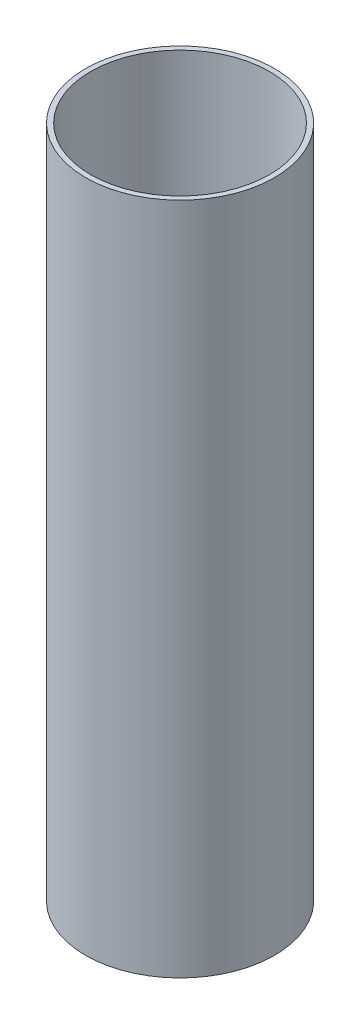
ISO-10303-21;
HEADER;
FILE_DESCRIPTION(('STEP AP214'),'2;1');
FILE_NAME('part.step','',(''),(''),'','','');
FILE_SCHEMA(('AUTOMOTIVE_DESIGN { 1 0 10303 214 1 1 1 1 }'));
ENDSEC;
DATA;
#1=APPLICATION_CONTEXT('core data for automotive mechanical design processes');
#2=APPLICATION_PROTOCOL_DEFINITION('international standard','automotive_design',2000,#1);
#3=PRODUCT_CONTEXT('',#1,'mechanical');
#4=PRODUCT('Part','Part','',(#3));
#5=PRODUCT_RELATED_PRODUCT_CATEGORY('part','',(#4));
#6=PRODUCT_DEFINITION_FORMATION('','',#4);
#7=PRODUCT_DEFINITION_CONTEXT('part definition',#1,'design');
#8=PRODUCT_DEFINITION('design','',#6,#7);
#9=PRODUCT_DEFINITION_SHAPE('','',#8);
#10=(LENGTH_UNIT() NAMED_UNIT(*) SI_UNIT(.MILLI.,.METRE.));
#11=(NAMED_UNIT(*) PLANE_ANGLE_UNIT() SI_UNIT($,.RADIAN.));
#12=(NAMED_UNIT(*) SI_UNIT($,.STERADIAN.) SOLID_ANGLE_UNIT());
#13=UNCERTAINTY_MEASURE_WITH_UNIT(LENGTH_MEASURE(1.E-05),#10,'distance_accuracy_value','');
#14=(GEOMETRIC_REPRESENTATION_CONTEXT(3) GLOBAL_UNCERTAINTY_ASSIGNED_CONTEXT((#13)) GLOBAL_UNIT_ASSIGNED_CONTEXT((#10,
#11,#12)) REPRESENTATION_CONTEXT('',''));
#15=CARTESIAN_POINT('',(0.,0.,0.));
#16=DIRECTION('',(0.,0.,1.));
#17=DIRECTION('',(1.,0.,0.));
#18=AXIS2_PLACEMENT_3D('',#15,#16,#17);
#19=CARTESIAN_POINT('',(0.,797.913336974403,0.));
#20=DIRECTION('',(0.,1.,0.));
#21=DIRECTION('',(0.,0.,1.));
#22=AXIS2_PLACEMENT_3D('',#19,#20,#21);
#23=CYLINDRICAL_SURFACE('',#22,26.9748);
#24=CARTESIAN_POINT('',(0.,0.,0.));
#25=DIRECTION('',(0.,1.,0.));
#26=DIRECTION('',(0.,0.,1.));
#27=AXIS2_PLACEMENT_3D('',#24,#25,#26);
#28=CIRCLE('',#27,26.9748);
#29=CARTESIAN_POINT('',(0.,0.,26.9748));
#30=VERTEX_POINT('',#29);
#31=EDGE_CURVE('E10',#30,#30,#28,.T.);
#32=ORIENTED_EDGE('',*,*,#31,.F.);
#33=EDGE_LOOP('',(#32));
#34=FACE_BOUND('',#33,.T.);
#35=CARTESIAN_POINT('',(0.,203.2,0.));
#36=DIRECTION('',(0.,1.,0.));
#37=DIRECTION('',(0.,0.,1.));
#38=AXIS2_PLACEMENT_3D('',#35,#36,#37);
#39=CIRCLE('',#38,26.9748);
#40=CARTESIAN_POINT('',(0.,203.2,26.9748));
#41=VERTEX_POINT('',#40);
#42=EDGE_CURVE('E50',#41,#41,#39,.T.);
#43=ORIENTED_EDGE('',*,*,#42,.T.);
#44=EDGE_LOOP('',(#43));
#45=FACE_BOUND('',#44,.T.);
#46=ADVANCED_FACE('F36',(#34,#45),#23,.F.);
#47=CARTESIAN_POINT('',(26.9748,0.,0.));
#48=DIRECTION('',(0.,1.,0.));
#49=DIRECTION('',(0.,0.,1.));
#50=AXIS2_PLACEMENT_3D('',#47,#48,#49);
#51=PLANE('',#50);
#52=CARTESIAN_POINT('',(0.,0.,0.));
#53=DIRECTION('',(0.,1.,0.));
#54=DIRECTION('',(0.,0.,1.));
#55=AXIS2_PLACEMENT_3D('',#52,#53,#54);
#56=CIRCLE('',#55,28.4988);
#57=CARTESIAN_POINT('',(0.,0.,28.4988));
#58=VERTEX_POINT('',#57);
#59=EDGE_CURVE('E42',#58,#58,#56,.T.);
#60=ORIENTED_EDGE('',*,*,#59,.F.);
#61=EDGE_LOOP('',(#60));
#62=FACE_BOUND('',#61,.T.);
#63=ORIENTED_EDGE('',*,*,#31,.T.);
#64=EDGE_LOOP('',(#63));
#65=FACE_BOUND('',#64,.T.);
#66=ADVANCED_FACE('F65',(#62,#65),#51,.F.);
#67=CARTESIAN_POINT('',(0.,797.913336974403,0.));
#68=DIRECTION('',(0.,1.,0.));
#69=DIRECTION('',(0.,0.,1.));
#70=AXIS2_PLACEMENT_3D('',#67,#68,#69);
#71=CYLINDRICAL_SURFACE('',#70,28.4988);
#72=CARTESIAN_POINT('',(0.,203.2,0.));
#73=DIRECTION('',(0.,1.,0.));
#74=DIRECTION('',(0.,0.,1.));
#75=AXIS2_PLACEMENT_3D('',#72,#73,#74);
#76=CIRCLE('',#75,28.4988);
#77=CARTESIAN_POINT('',(0.,203.2,28.4988));
#78=VERTEX_POINT('',#77);
#79=EDGE_CURVE('E46',#78,#78,#76,.T.);
#80=ORIENTED_EDGE('',*,*,#79,.F.);
#81=EDGE_LOOP('',(#80));
#82=FACE_BOUND('',#81,.T.);
#83=ORIENTED_EDGE('',*,*,#59,.T.);
#84=EDGE_LOOP('',(#83));
#85=FACE_BOUND('',#84,.T.);
#86=ADVANCED_FACE('F60',(#82,#85),#71,.T.);
#87=CARTESIAN_POINT('',(26.9748,203.2,0.));
#88=DIRECTION('',(0.,-1.,0.));
#89=DIRECTION('',(0.,0.,-1.));
#90=AXIS2_PLACEMENT_3D('',#87,#88,#89);
#91=PLANE('',#90);
#92=ORIENTED_EDGE('',*,*,#42,.F.);
#93=EDGE_LOOP('',(#92));
#94=FACE_BOUND('',#93,.T.);
#95=ORIENTED_EDGE('',*,*,#79,.T.);
#96=EDGE_LOOP('',(#95));
#97=FACE_BOUND('',#96,.T.);
#98=ADVANCED_FACE('F57',(#94,#97),#91,.F.);
#99=CLOSED_SHELL('',(#46,#66,#86,#98));
#100=MANIFOLD_SOLID_BREP('B2',#99);
#101=ADVANCED_BREP_SHAPE_REPRESENTATION('',(#18,#100),#14);
#102=SHAPE_DEFINITION_REPRESENTATION(#9,#101);
ENDSEC;
END-ISO-10303-21;
